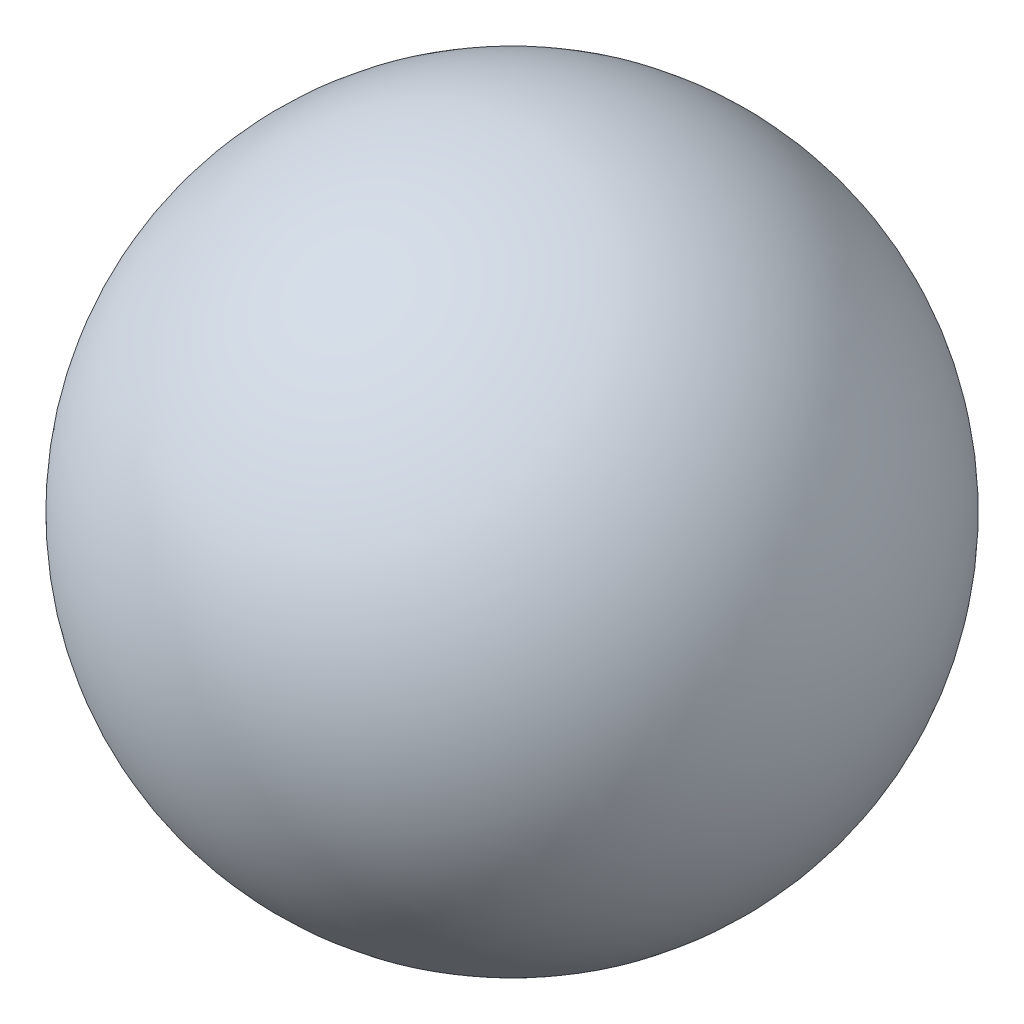
ISO-10303-21;
HEADER;
FILE_DESCRIPTION(('STEP AP214'),'2;1');
FILE_NAME('part.step','',(''),(''),'','','');
FILE_SCHEMA(('AUTOMOTIVE_DESIGN { 1 0 10303 214 1 1 1 1 }'));
ENDSEC;
DATA;
#1=APPLICATION_CONTEXT('core data for automotive mechanical design processes');
#2=APPLICATION_PROTOCOL_DEFINITION('international standard','automotive_design',2000,#1);
#3=PRODUCT_CONTEXT('',#1,'mechanical');
#4=PRODUCT('Part','Part','',(#3));
#5=PRODUCT_RELATED_PRODUCT_CATEGORY('part','',(#4));
#6=PRODUCT_DEFINITION_FORMATION('','',#4);
#7=PRODUCT_DEFINITION_CONTEXT('part definition',#1,'design');
#8=PRODUCT_DEFINITION('design','',#6,#7);
#9=PRODUCT_DEFINITION_SHAPE('','',#8);
#10=(LENGTH_UNIT() NAMED_UNIT(*) SI_UNIT(.MILLI.,.METRE.));
#11=(NAMED_UNIT(*) PLANE_ANGLE_UNIT() SI_UNIT($,.RADIAN.));
#12=(NAMED_UNIT(*) SI_UNIT($,.STERADIAN.) SOLID_ANGLE_UNIT());
#13=UNCERTAINTY_MEASURE_WITH_UNIT(LENGTH_MEASURE(1.E-05),#10,'distance_accuracy_value','');
#14=(GEOMETRIC_REPRESENTATION_CONTEXT(3) GLOBAL_UNCERTAINTY_ASSIGNED_CONTEXT((#13)) GLOBAL_UNIT_ASSIGNED_CONTEXT((#10,
#11,#12)) REPRESENTATION_CONTEXT('',''));
#15=CARTESIAN_POINT('',(0.,0.,0.));
#16=DIRECTION('',(0.,0.,1.));
#17=DIRECTION('',(1.,0.,0.));
#18=AXIS2_PLACEMENT_3D('',#15,#16,#17);
#19=CARTESIAN_POINT('',(0.,-0.64217247035018,0.));
#20=DIRECTION('',(0.,1.,0.));
#21=DIRECTION('',(1.,0.,0.));
#22=AXIS2_PLACEMENT_3D('',#19,#20,#21);
#23=SPHERICAL_SURFACE('',#22,4.3);
#24=CARTESIAN_POINT('',(0.,3.65782752964982,0.));
#25=VERTEX_POINT('',#24);
#26=VERTEX_LOOP('',#25);
#27=FACE_BOUND('',#26,.T.);
#28=ADVANCED_FACE('F28',(#27),#23,.T.);
#29=CLOSED_SHELL('',(#28));
#30=MANIFOLD_SOLID_BREP('B2',#29);
#31=ADVANCED_BREP_SHAPE_REPRESENTATION('',(#18,#30),#14);
#32=SHAPE_DEFINITION_REPRESENTATION(#9,#31);
ENDSEC;
END-ISO-10303-21;
